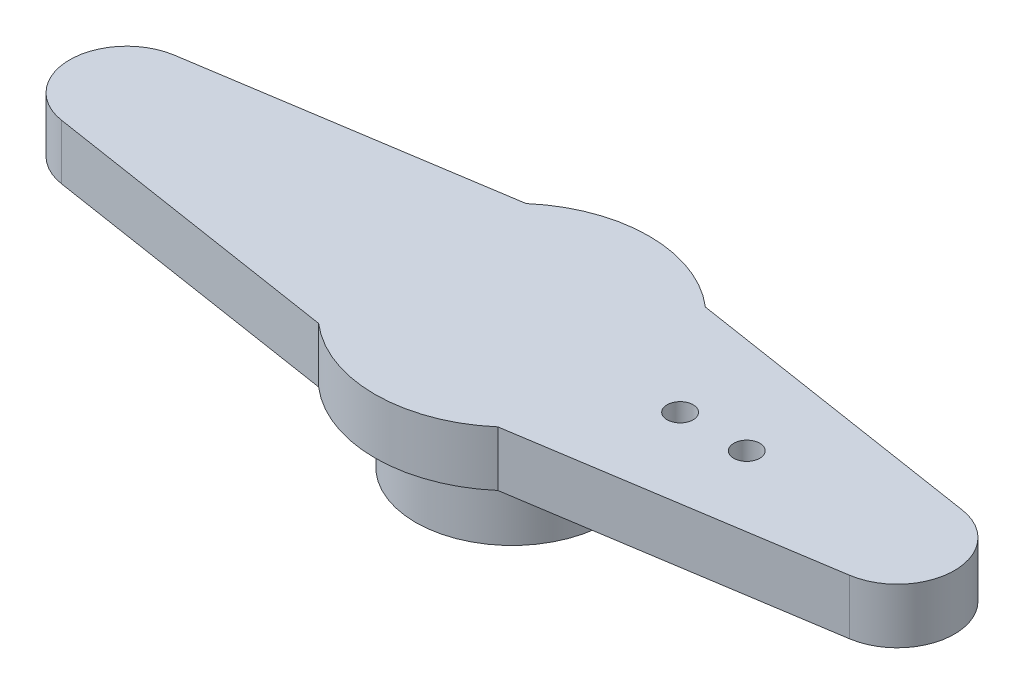
ISO-10303-21;
HEADER;
FILE_DESCRIPTION(('STEP AP214'),'2;1');
FILE_NAME('part.step','',(''),(''),'','','');
FILE_SCHEMA(('AUTOMOTIVE_DESIGN { 1 0 10303 214 1 1 1 1 }'));
ENDSEC;
DATA;
#1=APPLICATION_CONTEXT('core data for automotive mechanical design processes');
#2=APPLICATION_PROTOCOL_DEFINITION('international standard','automotive_design',2000,#1);
#3=PRODUCT_CONTEXT('',#1,'mechanical');
#4=PRODUCT('Part','Part','',(#3));
#5=PRODUCT_RELATED_PRODUCT_CATEGORY('part','',(#4));
#6=PRODUCT_DEFINITION_FORMATION('','',#4);
#7=PRODUCT_DEFINITION_CONTEXT('part definition',#1,'design');
#8=PRODUCT_DEFINITION('design','',#6,#7);
#9=PRODUCT_DEFINITION_SHAPE('','',#8);
#10=(LENGTH_UNIT() NAMED_UNIT(*) SI_UNIT(.MILLI.,.METRE.));
#11=(NAMED_UNIT(*) PLANE_ANGLE_UNIT() SI_UNIT($,.RADIAN.));
#12=(NAMED_UNIT(*) SI_UNIT($,.STERADIAN.) SOLID_ANGLE_UNIT());
#13=UNCERTAINTY_MEASURE_WITH_UNIT(LENGTH_MEASURE(1.E-05),#10,'distance_accuracy_value','');
#14=(GEOMETRIC_REPRESENTATION_CONTEXT(3) GLOBAL_UNCERTAINTY_ASSIGNED_CONTEXT((#13)) GLOBAL_UNIT_ASSIGNED_CONTEXT((#10,
#11,#12)) REPRESENTATION_CONTEXT('',''));
#15=CARTESIAN_POINT('',(0.,0.,0.));
#16=DIRECTION('',(0.,0.,1.));
#17=DIRECTION('',(1.,0.,0.));
#18=AXIS2_PLACEMENT_3D('',#15,#16,#17);
#19=CARTESIAN_POINT('',(0.,0.,0.));
#20=DIRECTION('',(0.,1.,0.));
#21=DIRECTION('',(0.,0.,1.));
#22=AXIS2_PLACEMENT_3D('',#19,#20,#21);
#23=PLANE('',#22);
#24=CARTESIAN_POINT('',(10.287,0.,0.));
#25=DIRECTION('',(0.,1.,0.));
#26=DIRECTION('',(0.,0.,1.));
#27=AXIS2_PLACEMENT_3D('',#24,#25,#26);
#28=CIRCLE('',#27,0.571499999999999);
#29=CARTESIAN_POINT('',(10.287,0.,0.571499999999998));
#30=VERTEX_POINT('',#29);
#31=EDGE_CURVE('E200',#30,#30,#28,.F.);
#32=ORIENTED_EDGE('',*,*,#31,.F.);
#33=EDGE_LOOP('',(#32));
#34=FACE_BOUND('',#33,.T.);
#35=CARTESIAN_POINT('',(7.366,0.,0.));
#36=DIRECTION('',(0.,1.,0.));
#37=DIRECTION('',(0.,0.,1.));
#38=AXIS2_PLACEMENT_3D('',#35,#36,#37);
#39=CIRCLE('',#38,0.5715);
#40=CARTESIAN_POINT('',(7.366,0.,0.5715));
#41=VERTEX_POINT('',#40);
#42=EDGE_CURVE('E189',#41,#41,#39,.F.);
#43=ORIENTED_EDGE('',*,*,#42,.F.);
#44=EDGE_LOOP('',(#43));
#45=FACE_BOUND('',#44,.T.);
#46=CARTESIAN_POINT('',(0.,0.,0.));
#47=DIRECTION('',(0.,1.,0.));
#48=DIRECTION('',(0.,0.,1.));
#49=AXIS2_PLACEMENT_3D('',#46,#47,#48);
#50=CIRCLE('',#49,6.0071);
#51=CARTESIAN_POINT('',(3.92602583409738,0.,-4.5466));
#52=VERTEX_POINT('',#51);
#53=CARTESIAN_POINT('',(-3.92602583409738,0.,-4.5466));
#54=VERTEX_POINT('',#53);
#55=EDGE_CURVE('E131',#52,#54,#50,.T.);
#56=ORIENTED_EDGE('',*,*,#55,.F.);
#57=DIRECTION('',(-0.988099301830636,0.,-0.153817325818029));
#58=VECTOR('',#57,1.);
#59=CARTESIAN_POINT('',(3.92602583409738,0.,-4.5466));
#60=LINE('',#59,#58);
#61=CARTESIAN_POINT('',(17.264827457222,0.,-2.47015));
#62=VERTEX_POINT('',#61);
#63=EDGE_CURVE('E85',#62,#52,#60,.T.);
#64=ORIENTED_EDGE('',*,*,#63,.F.);
#65=CARTESIAN_POINT('',(16.8802994379577,0.,0.));
#66=DIRECTION('',(0.,1.,0.));
#67=DIRECTION('',(0.,0.,-1.));
#68=AXIS2_PLACEMENT_3D('',#65,#66,#67);
#69=CIRCLE('',#68,2.49990056204229);
#70=CARTESIAN_POINT('',(17.264827457222,0.,2.47015));
#71=VERTEX_POINT('',#70);
#72=EDGE_CURVE('E79',#71,#62,#69,.T.);
#73=ORIENTED_EDGE('',*,*,#72,.F.);
#74=DIRECTION('',(0.988099301830636,0.,-0.153817325818029));
#75=VECTOR('',#74,1.);
#76=CARTESIAN_POINT('',(3.92602583409738,0.,4.5466));
#77=LINE('',#76,#75);
#78=CARTESIAN_POINT('',(3.92602583409738,0.,4.5466));
#79=VERTEX_POINT('',#78);
#80=EDGE_CURVE('E121',#79,#71,#77,.T.);
#81=ORIENTED_EDGE('',*,*,#80,.F.);
#82=CARTESIAN_POINT('',(0.,0.,0.));
#83=DIRECTION('',(0.,1.,0.));
#84=DIRECTION('',(0.,0.,1.));
#85=AXIS2_PLACEMENT_3D('',#82,#83,#84);
#86=CIRCLE('',#85,6.0071);
#87=CARTESIAN_POINT('',(-3.92602583409738,0.,4.5466));
#88=VERTEX_POINT('',#87);
#89=EDGE_CURVE('E141',#88,#79,#86,.T.);
#90=ORIENTED_EDGE('',*,*,#89,.F.);
#91=DIRECTION('',(0.988099301830636,0.,0.153817325818029));
#92=VECTOR('',#91,1.);
#93=CARTESIAN_POINT('',(-3.92602583409738,0.,4.5466));
#94=LINE('',#93,#92);
#95=CARTESIAN_POINT('',(-17.264827457222,0.,2.47015));
#96=VERTEX_POINT('',#95);
#97=EDGE_CURVE('E139',#96,#88,#94,.T.);
#98=ORIENTED_EDGE('',*,*,#97,.F.);
#99=CARTESIAN_POINT('',(-16.8802994379577,0.,0.));
#100=DIRECTION('',(0.,1.,0.));
#101=DIRECTION('',(0.,0.,1.));
#102=AXIS2_PLACEMENT_3D('',#99,#100,#101);
#103=CIRCLE('',#102,2.49990056204229);
#104=CARTESIAN_POINT('',(-17.264827457222,0.,-2.47015));
#105=VERTEX_POINT('',#104);
#106=EDGE_CURVE('E137',#105,#96,#103,.T.);
#107=ORIENTED_EDGE('',*,*,#106,.F.);
#108=DIRECTION('',(-0.988099301830636,0.,0.153817325818029));
#109=VECTOR('',#108,1.);
#110=CARTESIAN_POINT('',(-3.92602583409738,0.,-4.5466));
#111=LINE('',#110,#109);
#112=EDGE_CURVE('E134',#54,#105,#111,.T.);
#113=ORIENTED_EDGE('',*,*,#112,.F.);
#114=EDGE_LOOP('',(#56,#64,#73,#81,#90,#98,#107,#113));
#115=FACE_BOUND('',#114,.T.);
#116=CARTESIAN_POINT('',(0.,0.,0.));
#117=DIRECTION('',(0.,1.,0.));
#118=DIRECTION('',(0.,0.,1.));
#119=AXIS2_PLACEMENT_3D('',#116,#117,#118);
#120=CIRCLE('',#119,4.22275);
#121=CARTESIAN_POINT('',(0.,0.,4.22275));
#122=VERTEX_POINT('',#121);
#123=EDGE_CURVE('E11',#122,#122,#120,.F.);
#124=ORIENTED_EDGE('',*,*,#123,.F.);
#125=EDGE_LOOP('',(#124));
#126=FACE_BOUND('',#125,.T.);
#127=ADVANCED_FACE('F33',(#34,#45,#115,#126),#23,.F.);
#128=CARTESIAN_POINT('',(0.,2.413,0.));
#129=DIRECTION('',(0.,-1.,0.));
#130=DIRECTION('',(0.,0.,-1.));
#131=AXIS2_PLACEMENT_3D('',#128,#129,#130);
#132=CYLINDRICAL_SURFACE('',#131,6.0071);
#133=ORIENTED_EDGE('',*,*,#55,.T.);
#134=DIRECTION('',(0.,-1.,0.));
#135=VECTOR('',#134,1.);
#136=CARTESIAN_POINT('',(-3.92602583409738,2.413,-4.5466));
#137=LINE('',#136,#135);
#138=CARTESIAN_POINT('',(-3.92602583409738,2.413,-4.5466));
#139=VERTEX_POINT('',#138);
#140=EDGE_CURVE('E42',#139,#54,#137,.T.);
#141=ORIENTED_EDGE('',*,*,#140,.F.);
#142=CARTESIAN_POINT('',(0.,2.413,0.));
#143=DIRECTION('',(0.,1.,0.));
#144=DIRECTION('',(0.,0.,1.));
#145=AXIS2_PLACEMENT_3D('',#142,#143,#144);
#146=CIRCLE('',#145,6.0071);
#147=CARTESIAN_POINT('',(3.92602583409738,2.413,-4.5466));
#148=VERTEX_POINT('',#147);
#149=EDGE_CURVE('E146',#148,#139,#146,.T.);
#150=ORIENTED_EDGE('',*,*,#149,.F.);
#151=DIRECTION('',(0.,-1.,0.));
#152=VECTOR('',#151,1.);
#153=CARTESIAN_POINT('',(3.92602583409738,2.413,-4.5466));
#154=LINE('',#153,#152);
#155=EDGE_CURVE('E127',#148,#52,#154,.T.);
#156=ORIENTED_EDGE('',*,*,#155,.T.);
#157=EDGE_LOOP('',(#133,#141,#150,#156));
#158=FACE_BOUND('',#157,.T.);
#159=ADVANCED_FACE('F35',(#158),#132,.T.);
#160=CARTESIAN_POINT('',(-3.92602583409738,2.413,-4.5466));
#161=DIRECTION('',(0.153817325818029,0.,0.988099301830636));
#162=DIRECTION('',(0.988099301830636,0.,-0.153817325818029));
#163=AXIS2_PLACEMENT_3D('',#160,#161,#162);
#164=PLANE('',#163);
#165=ORIENTED_EDGE('',*,*,#112,.T.);
#166=DIRECTION('',(0.,-1.,0.));
#167=VECTOR('',#166,1.);
#168=CARTESIAN_POINT('',(-17.264827457222,2.413,-2.47015));
#169=LINE('',#168,#167);
#170=CARTESIAN_POINT('',(-17.264827457222,2.413,-2.47015));
#171=VERTEX_POINT('',#170);
#172=EDGE_CURVE('E156',#171,#105,#169,.T.);
#173=ORIENTED_EDGE('',*,*,#172,.F.);
#174=DIRECTION('',(-0.988099301830636,0.,0.153817325818029));
#175=VECTOR('',#174,1.);
#176=CARTESIAN_POINT('',(-3.92602583409738,2.413,-4.5466));
#177=LINE('',#176,#175);
#178=EDGE_CURVE('E94',#139,#171,#177,.T.);
#179=ORIENTED_EDGE('',*,*,#178,.F.);
#180=ORIENTED_EDGE('',*,*,#140,.T.);
#181=EDGE_LOOP('',(#165,#173,#179,#180));
#182=FACE_BOUND('',#181,.T.);
#183=ADVANCED_FACE('F159',(#182),#164,.F.);
#184=CARTESIAN_POINT('',(-16.8802994379577,2.413,0.));
#185=DIRECTION('',(0.,-1.,0.));
#186=DIRECTION('',(0.,0.,-1.));
#187=AXIS2_PLACEMENT_3D('',#184,#185,#186);
#188=CYLINDRICAL_SURFACE('',#187,2.49990056204229);
#189=ORIENTED_EDGE('',*,*,#106,.T.);
#190=DIRECTION('',(0.,-1.,0.));
#191=VECTOR('',#190,1.);
#192=CARTESIAN_POINT('',(-17.264827457222,2.413,2.47015));
#193=LINE('',#192,#191);
#194=CARTESIAN_POINT('',(-17.264827457222,2.413,2.47015));
#195=VERTEX_POINT('',#194);
#196=EDGE_CURVE('E153',#195,#96,#193,.T.);
#197=ORIENTED_EDGE('',*,*,#196,.F.);
#198=CARTESIAN_POINT('',(-16.8802994379577,2.413,0.));
#199=DIRECTION('',(0.,1.,0.));
#200=DIRECTION('',(0.,0.,1.));
#201=AXIS2_PLACEMENT_3D('',#198,#199,#200);
#202=CIRCLE('',#201,2.49990056204229);
#203=EDGE_CURVE('E177',#171,#195,#202,.T.);
#204=ORIENTED_EDGE('',*,*,#203,.F.);
#205=ORIENTED_EDGE('',*,*,#172,.T.);
#206=EDGE_LOOP('',(#189,#197,#204,#205));
#207=FACE_BOUND('',#206,.T.);
#208=ADVANCED_FACE('F170',(#207),#188,.T.);
#209=CARTESIAN_POINT('',(-3.92602583409738,2.413,4.5466));
#210=DIRECTION('',(0.153817325818029,0.,-0.988099301830636));
#211=DIRECTION('',(-0.988099301830636,0.,-0.153817325818029));
#212=AXIS2_PLACEMENT_3D('',#209,#210,#211);
#213=PLANE('',#212);
#214=ORIENTED_EDGE('',*,*,#97,.T.);
#215=DIRECTION('',(0.,-1.,0.));
#216=VECTOR('',#215,1.);
#217=CARTESIAN_POINT('',(-3.92602583409738,2.413,4.5466));
#218=LINE('',#217,#216);
#219=CARTESIAN_POINT('',(-3.92602583409738,2.413,4.5466));
#220=VERTEX_POINT('',#219);
#221=EDGE_CURVE('E150',#220,#88,#218,.T.);
#222=ORIENTED_EDGE('',*,*,#221,.F.);
#223=DIRECTION('',(0.988099301830636,0.,0.153817325818029));
#224=VECTOR('',#223,1.);
#225=CARTESIAN_POINT('',(-3.92602583409738,2.413,4.5466));
#226=LINE('',#225,#224);
#227=EDGE_CURVE('E176',#195,#220,#226,.T.);
#228=ORIENTED_EDGE('',*,*,#227,.F.);
#229=ORIENTED_EDGE('',*,*,#196,.T.);
#230=EDGE_LOOP('',(#214,#222,#228,#229));
#231=FACE_BOUND('',#230,.T.);
#232=ADVANCED_FACE('F174',(#231),#213,.F.);
#233=CARTESIAN_POINT('',(0.,2.413,0.));
#234=DIRECTION('',(0.,-1.,0.));
#235=DIRECTION('',(0.,0.,-1.));
#236=AXIS2_PLACEMENT_3D('',#233,#234,#235);
#237=CYLINDRICAL_SURFACE('',#236,6.0071);
#238=ORIENTED_EDGE('',*,*,#89,.T.);
#239=DIRECTION('',(0.,-1.,0.));
#240=VECTOR('',#239,1.);
#241=CARTESIAN_POINT('',(3.92602583409738,2.413,4.5466));
#242=LINE('',#241,#240);
#243=CARTESIAN_POINT('',(3.92602583409738,2.413,4.5466));
#244=VERTEX_POINT('',#243);
#245=EDGE_CURVE('E122',#244,#79,#242,.T.);
#246=ORIENTED_EDGE('',*,*,#245,.F.);
#247=CARTESIAN_POINT('',(0.,2.413,0.));
#248=DIRECTION('',(0.,1.,0.));
#249=DIRECTION('',(0.,0.,1.));
#250=AXIS2_PLACEMENT_3D('',#247,#248,#249);
#251=CIRCLE('',#250,6.0071);
#252=EDGE_CURVE('E113',#220,#244,#251,.T.);
#253=ORIENTED_EDGE('',*,*,#252,.F.);
#254=ORIENTED_EDGE('',*,*,#221,.T.);
#255=EDGE_LOOP('',(#238,#246,#253,#254));
#256=FACE_BOUND('',#255,.T.);
#257=ADVANCED_FACE('F246',(#256),#237,.T.);
#258=CARTESIAN_POINT('',(3.92602583409738,2.413,4.5466));
#259=DIRECTION('',(-0.153817325818029,0.,-0.988099301830636));
#260=DIRECTION('',(-0.988099301830636,0.,0.153817325818029));
#261=AXIS2_PLACEMENT_3D('',#258,#259,#260);
#262=PLANE('',#261);
#263=ORIENTED_EDGE('',*,*,#80,.T.);
#264=DIRECTION('',(0.,-1.,0.));
#265=VECTOR('',#264,1.);
#266=CARTESIAN_POINT('',(17.264827457222,2.413,2.47015));
#267=LINE('',#266,#265);
#268=CARTESIAN_POINT('',(17.264827457222,2.413,2.47015));
#269=VERTEX_POINT('',#268);
#270=EDGE_CURVE('E118',#269,#71,#267,.T.);
#271=ORIENTED_EDGE('',*,*,#270,.F.);
#272=DIRECTION('',(0.988099301830636,0.,-0.153817325818029));
#273=VECTOR('',#272,1.);
#274=CARTESIAN_POINT('',(3.92602583409738,2.413,4.5466));
#275=LINE('',#274,#273);
#276=EDGE_CURVE('E107',#244,#269,#275,.T.);
#277=ORIENTED_EDGE('',*,*,#276,.F.);
#278=ORIENTED_EDGE('',*,*,#245,.T.);
#279=EDGE_LOOP('',(#263,#271,#277,#278));
#280=FACE_BOUND('',#279,.T.);
#281=ADVANCED_FACE('F119',(#280),#262,.F.);
#282=CARTESIAN_POINT('',(16.8802994379577,2.413,0.));
#283=DIRECTION('',(0.,-1.,0.));
#284=DIRECTION('',(0.,0.,-1.));
#285=AXIS2_PLACEMENT_3D('',#282,#283,#284);
#286=CYLINDRICAL_SURFACE('',#285,2.49990056204229);
#287=ORIENTED_EDGE('',*,*,#72,.T.);
#288=DIRECTION('',(0.,-1.,0.));
#289=VECTOR('',#288,1.);
#290=CARTESIAN_POINT('',(17.264827457222,2.413,-2.47015));
#291=LINE('',#290,#289);
#292=CARTESIAN_POINT('',(17.264827457222,2.413,-2.47015));
#293=VERTEX_POINT('',#292);
#294=EDGE_CURVE('E123',#293,#62,#291,.T.);
#295=ORIENTED_EDGE('',*,*,#294,.F.);
#296=CARTESIAN_POINT('',(16.8802994379577,2.413,0.));
#297=DIRECTION('',(0.,1.,0.));
#298=DIRECTION('',(0.,0.,-1.));
#299=AXIS2_PLACEMENT_3D('',#296,#297,#298);
#300=CIRCLE('',#299,2.49990056204229);
#301=EDGE_CURVE('E111',#269,#293,#300,.T.);
#302=ORIENTED_EDGE('',*,*,#301,.F.);
#303=ORIENTED_EDGE('',*,*,#270,.T.);
#304=EDGE_LOOP('',(#287,#295,#302,#303));
#305=FACE_BOUND('',#304,.T.);
#306=ADVANCED_FACE('F125',(#305),#286,.T.);
#307=CARTESIAN_POINT('',(3.92602583409738,2.413,-4.5466));
#308=DIRECTION('',(-0.153817325818029,0.,0.988099301830636));
#309=DIRECTION('',(0.988099301830636,0.,0.153817325818029));
#310=AXIS2_PLACEMENT_3D('',#307,#308,#309);
#311=PLANE('',#310);
#312=ORIENTED_EDGE('',*,*,#63,.T.);
#313=ORIENTED_EDGE('',*,*,#155,.F.);
#314=DIRECTION('',(-0.988099301830636,0.,-0.153817325818029));
#315=VECTOR('',#314,1.);
#316=CARTESIAN_POINT('',(3.92602583409738,2.413,-4.5466));
#317=LINE('',#316,#315);
#318=EDGE_CURVE('E50',#293,#148,#317,.T.);
#319=ORIENTED_EDGE('',*,*,#318,.F.);
#320=ORIENTED_EDGE('',*,*,#294,.T.);
#321=EDGE_LOOP('',(#312,#313,#319,#320));
#322=FACE_BOUND('',#321,.T.);
#323=ADVANCED_FACE('F237',(#322),#311,.F.);
#324=CARTESIAN_POINT('',(0.,2.413,0.));
#325=DIRECTION('',(0.,1.,0.));
#326=DIRECTION('',(0.,0.,1.));
#327=AXIS2_PLACEMENT_3D('',#324,#325,#326);
#328=PLANE('',#327);
#329=CARTESIAN_POINT('',(10.287,2.413,0.));
#330=DIRECTION('',(0.,1.,0.));
#331=DIRECTION('',(0.,0.,1.));
#332=AXIS2_PLACEMENT_3D('',#329,#330,#331);
#333=CIRCLE('',#332,0.571499999999999);
#334=CARTESIAN_POINT('',(10.287,2.413,0.571499999999998));
#335=VERTEX_POINT('',#334);
#336=EDGE_CURVE('E197',#335,#335,#333,.T.);
#337=ORIENTED_EDGE('',*,*,#336,.F.);
#338=EDGE_LOOP('',(#337));
#339=FACE_BOUND('',#338,.T.);
#340=CARTESIAN_POINT('',(7.366,2.413,0.));
#341=DIRECTION('',(0.,1.,0.));
#342=DIRECTION('',(0.,0.,1.));
#343=AXIS2_PLACEMENT_3D('',#340,#341,#342);
#344=CIRCLE('',#343,0.5715);
#345=CARTESIAN_POINT('',(7.366,2.413,0.5715));
#346=VERTEX_POINT('',#345);
#347=EDGE_CURVE('E194',#346,#346,#344,.T.);
#348=ORIENTED_EDGE('',*,*,#347,.F.);
#349=EDGE_LOOP('',(#348));
#350=FACE_BOUND('',#349,.T.);
#351=ORIENTED_EDGE('',*,*,#149,.T.);
#352=ORIENTED_EDGE('',*,*,#178,.T.);
#353=ORIENTED_EDGE('',*,*,#203,.T.);
#354=ORIENTED_EDGE('',*,*,#227,.T.);
#355=ORIENTED_EDGE('',*,*,#252,.T.);
#356=ORIENTED_EDGE('',*,*,#276,.T.);
#357=ORIENTED_EDGE('',*,*,#301,.T.);
#358=ORIENTED_EDGE('',*,*,#318,.T.);
#359=EDGE_LOOP('',(#351,#352,#353,#354,#355,#356,#357,#358));
#360=FACE_BOUND('',#359,.T.);
#361=ADVANCED_FACE('F109',(#339,#350,#360),#328,.T.);
#362=CARTESIAN_POINT('',(0.,-3.3401,0.));
#363=DIRECTION('',(0.,-1.,0.));
#364=DIRECTION('',(0.,0.,-1.));
#365=AXIS2_PLACEMENT_3D('',#362,#363,#364);
#366=PLANE('',#365);
#367=CARTESIAN_POINT('',(0.,-3.3401,0.));
#368=DIRECTION('',(0.,-1.,0.));
#369=DIRECTION('',(0.,0.,-1.));
#370=AXIS2_PLACEMENT_3D('',#367,#368,#369);
#371=CIRCLE('',#370,4.22275);
#372=CARTESIAN_POINT('',(0.,-3.3401,-4.22275));
#373=VERTEX_POINT('',#372);
#374=EDGE_CURVE('E135',#373,#373,#371,.T.);
#375=ORIENTED_EDGE('',*,*,#374,.T.);
#376=EDGE_LOOP('',(#375));
#377=FACE_BOUND('',#376,.T.);
#378=CARTESIAN_POINT('',(0.,-3.3401,0.));
#379=DIRECTION('',(0.,-1.,0.));
#380=DIRECTION('',(0.,0.,-1.));
#381=AXIS2_PLACEMENT_3D('',#378,#379,#380);
#382=CIRCLE('',#381,2.8829);
#383=CARTESIAN_POINT('',(0.,-3.3401,-2.8829));
#384=VERTEX_POINT('',#383);
#385=EDGE_CURVE('E185',#384,#384,#382,.T.);
#386=ORIENTED_EDGE('',*,*,#385,.F.);
#387=EDGE_LOOP('',(#386));
#388=FACE_BOUND('',#387,.T.);
#389=ADVANCED_FACE('F229',(#377,#388),#366,.T.);
#390=CARTESIAN_POINT('',(0.,-3.3401,0.));
#391=DIRECTION('',(0.,1.,0.));
#392=DIRECTION('',(0.,0.,1.));
#393=AXIS2_PLACEMENT_3D('',#390,#391,#392);
#394=CYLINDRICAL_SURFACE('',#393,4.22275);
#395=ORIENTED_EDGE('',*,*,#374,.F.);
#396=EDGE_LOOP('',(#395));
#397=FACE_BOUND('',#396,.T.);
#398=ORIENTED_EDGE('',*,*,#123,.T.);
#399=EDGE_LOOP('',(#398));
#400=FACE_BOUND('',#399,.T.);
#401=ADVANCED_FACE('F227',(#397,#400),#394,.T.);
#402=CARTESIAN_POINT('',(0.,-3.3401,0.));
#403=DIRECTION('',(0.,1.,0.));
#404=DIRECTION('',(0.,0.,1.));
#405=AXIS2_PLACEMENT_3D('',#402,#403,#404);
#406=CYLINDRICAL_SURFACE('',#405,2.8829);
#407=ORIENTED_EDGE('',*,*,#385,.T.);
#408=EDGE_LOOP('',(#407));
#409=FACE_BOUND('',#408,.T.);
#410=CARTESIAN_POINT('',(0.,0.,0.));
#411=DIRECTION('',(0.,-1.,0.));
#412=DIRECTION('',(0.,0.,-1.));
#413=AXIS2_PLACEMENT_3D('',#410,#411,#412);
#414=CIRCLE('',#413,2.8829);
#415=CARTESIAN_POINT('',(0.,0.,-2.8829));
#416=VERTEX_POINT('',#415);
#417=EDGE_CURVE('E186',#416,#416,#414,.T.);
#418=ORIENTED_EDGE('',*,*,#417,.F.);
#419=EDGE_LOOP('',(#418));
#420=FACE_BOUND('',#419,.T.);
#421=ADVANCED_FACE('F222',(#409,#420),#406,.F.);
#422=ORIENTED_EDGE('',*,*,#417,.T.);
#423=EDGE_LOOP('',(#422));
#424=FACE_BOUND('',#423,.T.);
#425=ADVANCED_FACE('F209',(#424),#23,.F.);
#426=CARTESIAN_POINT('',(7.366,-3.3411,0.));
#427=DIRECTION('',(0.,1.,0.));
#428=DIRECTION('',(0.,0.,1.));
#429=AXIS2_PLACEMENT_3D('',#426,#427,#428);
#430=CYLINDRICAL_SURFACE('',#429,0.5715);
#431=ORIENTED_EDGE('',*,*,#347,.T.);
#432=EDGE_LOOP('',(#431));
#433=FACE_BOUND('',#432,.T.);
#434=ORIENTED_EDGE('',*,*,#42,.T.);
#435=EDGE_LOOP('',(#434));
#436=FACE_BOUND('',#435,.T.);
#437=ADVANCED_FACE('F212',(#433,#436),#430,.F.);
#438=CARTESIAN_POINT('',(10.287,-3.3411,0.));
#439=DIRECTION('',(0.,1.,0.));
#440=DIRECTION('',(0.,0.,1.));
#441=AXIS2_PLACEMENT_3D('',#438,#439,#440);
#442=CYLINDRICAL_SURFACE('',#441,0.571499999999999);
#443=ORIENTED_EDGE('',*,*,#336,.T.);
#444=EDGE_LOOP('',(#443));
#445=FACE_BOUND('',#444,.T.);
#446=ORIENTED_EDGE('',*,*,#31,.T.);
#447=EDGE_LOOP('',(#446));
#448=FACE_BOUND('',#447,.T.);
#449=ADVANCED_FACE('F204',(#445,#448),#442,.F.);
#450=CLOSED_SHELL('',(#127,#159,#183,#208,#232,#257,#281,#306,#323,#361,#389,#401,#421,#425,
#437,#449));
#451=MANIFOLD_SOLID_BREP('B2',#450);
#452=ADVANCED_BREP_SHAPE_REPRESENTATION('',(#18,#451),#14);
#453=SHAPE_DEFINITION_REPRESENTATION(#9,#452);
ENDSEC;
END-ISO-10303-21;
